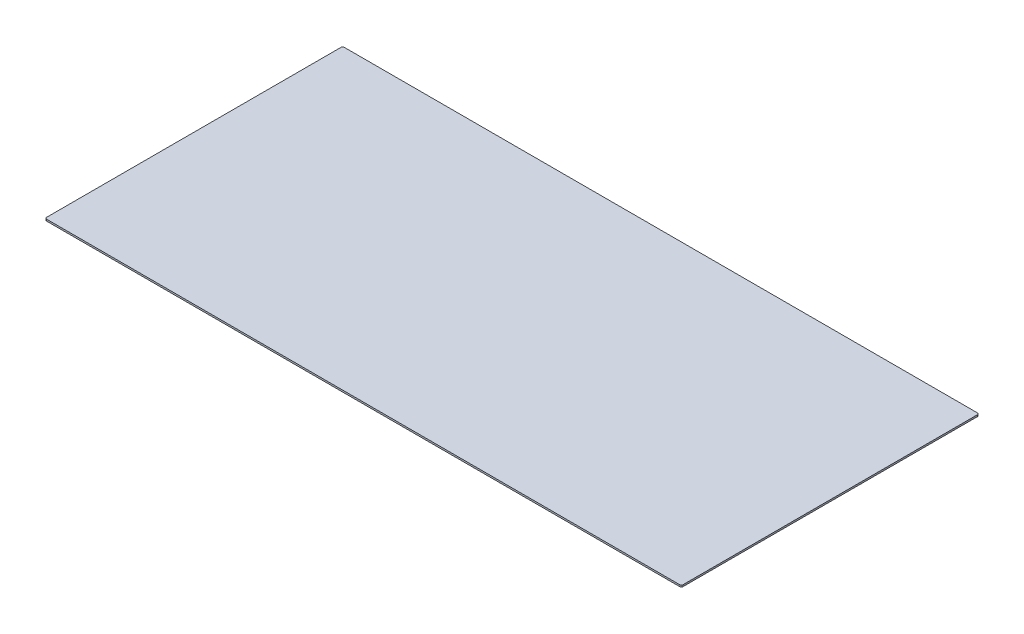
ISO-10303-21;
HEADER;
FILE_DESCRIPTION(('STEP AP214'),'2;1');
FILE_NAME('part.step','',(''),(''),'','','');
FILE_SCHEMA(('AUTOMOTIVE_DESIGN { 1 0 10303 214 1 1 1 1 }'));
ENDSEC;
DATA;
#1=APPLICATION_CONTEXT('core data for automotive mechanical design processes');
#2=APPLICATION_PROTOCOL_DEFINITION('international standard','automotive_design',2000,#1);
#3=PRODUCT_CONTEXT('',#1,'mechanical');
#4=PRODUCT('Part','Part','',(#3));
#5=PRODUCT_RELATED_PRODUCT_CATEGORY('part','',(#4));
#6=PRODUCT_DEFINITION_FORMATION('','',#4);
#7=PRODUCT_DEFINITION_CONTEXT('part definition',#1,'design');
#8=PRODUCT_DEFINITION('design','',#6,#7);
#9=PRODUCT_DEFINITION_SHAPE('','',#8);
#10=(LENGTH_UNIT() NAMED_UNIT(*) SI_UNIT(.MILLI.,.METRE.));
#11=(NAMED_UNIT(*) PLANE_ANGLE_UNIT() SI_UNIT($,.RADIAN.));
#12=(NAMED_UNIT(*) SI_UNIT($,.STERADIAN.) SOLID_ANGLE_UNIT());
#13=UNCERTAINTY_MEASURE_WITH_UNIT(LENGTH_MEASURE(1.E-05),#10,'distance_accuracy_value','');
#14=(GEOMETRIC_REPRESENTATION_CONTEXT(3) GLOBAL_UNCERTAINTY_ASSIGNED_CONTEXT((#13)) GLOBAL_UNIT_ASSIGNED_CONTEXT((#10,
#11,#12)) REPRESENTATION_CONTEXT('',''));
#15=CARTESIAN_POINT('',(0.,0.,0.));
#16=DIRECTION('',(0.,0.,1.));
#17=DIRECTION('',(1.,0.,0.));
#18=AXIS2_PLACEMENT_3D('',#15,#16,#17);
#19=CARTESIAN_POINT('',(587.375,3.175,-273.05));
#20=DIRECTION('',(0.,-1.,0.));
#21=DIRECTION('',(0.,0.,-1.));
#22=AXIS2_PLACEMENT_3D('',#19,#20,#21);
#23=CYLINDRICAL_SURFACE('',#22,3.17500000000001);
#24=CARTESIAN_POINT('',(587.375,0.,-273.05));
#25=DIRECTION('',(0.,1.,0.));
#26=DIRECTION('',(0.,0.,-1.));
#27=AXIS2_PLACEMENT_3D('',#24,#25,#26);
#28=CIRCLE('',#27,3.17500000000001);
#29=CARTESIAN_POINT('',(590.55,0.,-273.05));
#30=VERTEX_POINT('',#29);
#31=CARTESIAN_POINT('',(587.375,0.,-276.225));
#32=VERTEX_POINT('',#31);
#33=EDGE_CURVE('E131',#30,#32,#28,.T.);
#34=ORIENTED_EDGE('',*,*,#33,.T.);
#35=DIRECTION('',(0.,-1.,0.));
#36=VECTOR('',#35,1.);
#37=CARTESIAN_POINT('',(587.375,3.175,-276.225));
#38=LINE('',#37,#36);
#39=CARTESIAN_POINT('',(587.375,3.175,-276.225));
#40=VERTEX_POINT('',#39);
#41=EDGE_CURVE('E11',#40,#32,#38,.T.);
#42=ORIENTED_EDGE('',*,*,#41,.F.);
#43=CARTESIAN_POINT('',(587.375,3.175,-273.05));
#44=DIRECTION('',(0.,1.,0.));
#45=DIRECTION('',(0.,0.,-1.));
#46=AXIS2_PLACEMENT_3D('',#43,#44,#45);
#47=CIRCLE('',#46,3.17500000000001);
#48=CARTESIAN_POINT('',(590.55,3.175,-273.05));
#49=VERTEX_POINT('',#48);
#50=EDGE_CURVE('E145',#49,#40,#47,.T.);
#51=ORIENTED_EDGE('',*,*,#50,.F.);
#52=DIRECTION('',(0.,-1.,0.));
#53=VECTOR('',#52,1.);
#54=CARTESIAN_POINT('',(590.55,3.175,-273.05));
#55=LINE('',#54,#53);
#56=EDGE_CURVE('E127',#49,#30,#55,.T.);
#57=ORIENTED_EDGE('',*,*,#56,.T.);
#58=EDGE_LOOP('',(#34,#42,#51,#57));
#59=FACE_BOUND('',#58,.T.);
#60=ADVANCED_FACE('F35',(#59),#23,.T.);
#61=CARTESIAN_POINT('',(-587.375,3.175,-276.225));
#62=DIRECTION('',(0.,0.,1.));
#63=DIRECTION('',(1.,0.,0.));
#64=AXIS2_PLACEMENT_3D('',#61,#62,#63);
#65=PLANE('',#64);
#66=DIRECTION('',(-1.,0.,0.));
#67=VECTOR('',#66,1.);
#68=CARTESIAN_POINT('',(-587.375,0.,-276.225));
#69=LINE('',#68,#67);
#70=CARTESIAN_POINT('',(-587.375,0.,-276.225));
#71=VERTEX_POINT('',#70);
#72=EDGE_CURVE('E134',#32,#71,#69,.T.);
#73=ORIENTED_EDGE('',*,*,#72,.T.);
#74=DIRECTION('',(0.,-1.,0.));
#75=VECTOR('',#74,1.);
#76=CARTESIAN_POINT('',(-587.375,3.175,-276.225));
#77=LINE('',#76,#75);
#78=CARTESIAN_POINT('',(-587.375,3.175,-276.225));
#79=VERTEX_POINT('',#78);
#80=EDGE_CURVE('E43',#79,#71,#77,.T.);
#81=ORIENTED_EDGE('',*,*,#80,.F.);
#82=DIRECTION('',(-1.,0.,0.));
#83=VECTOR('',#82,1.);
#84=CARTESIAN_POINT('',(-587.375,3.175,-276.225));
#85=LINE('',#84,#83);
#86=EDGE_CURVE('E94',#40,#79,#85,.T.);
#87=ORIENTED_EDGE('',*,*,#86,.F.);
#88=ORIENTED_EDGE('',*,*,#41,.T.);
#89=EDGE_LOOP('',(#73,#81,#87,#88));
#90=FACE_BOUND('',#89,.T.);
#91=ADVANCED_FACE('F180',(#90),#65,.F.);
#92=CARTESIAN_POINT('',(-587.375,3.175,-273.05));
#93=DIRECTION('',(0.,-1.,0.));
#94=DIRECTION('',(0.,0.,-1.));
#95=AXIS2_PLACEMENT_3D('',#92,#93,#94);
#96=CYLINDRICAL_SURFACE('',#95,3.17500000000001);
#97=CARTESIAN_POINT('',(-587.375,0.,-273.05));
#98=DIRECTION('',(0.,1.,0.));
#99=DIRECTION('',(0.,0.,-1.));
#100=AXIS2_PLACEMENT_3D('',#97,#98,#99);
#101=CIRCLE('',#100,3.17500000000001);
#102=CARTESIAN_POINT('',(-590.55,0.,-273.05));
#103=VERTEX_POINT('',#102);
#104=EDGE_CURVE('E136',#71,#103,#101,.T.);
#105=ORIENTED_EDGE('',*,*,#104,.T.);
#106=DIRECTION('',(0.,-1.,0.));
#107=VECTOR('',#106,1.);
#108=CARTESIAN_POINT('',(-590.55,3.175,-273.05));
#109=LINE('',#108,#107);
#110=CARTESIAN_POINT('',(-590.55,3.175,-273.05));
#111=VERTEX_POINT('',#110);
#112=EDGE_CURVE('E152',#111,#103,#109,.T.);
#113=ORIENTED_EDGE('',*,*,#112,.F.);
#114=CARTESIAN_POINT('',(-587.375,3.175,-273.05));
#115=DIRECTION('',(0.,1.,0.));
#116=DIRECTION('',(0.,0.,-1.));
#117=AXIS2_PLACEMENT_3D('',#114,#115,#116);
#118=CIRCLE('',#117,3.17500000000001);
#119=EDGE_CURVE('E160',#79,#111,#118,.T.);
#120=ORIENTED_EDGE('',*,*,#119,.F.);
#121=ORIENTED_EDGE('',*,*,#80,.T.);
#122=EDGE_LOOP('',(#105,#113,#120,#121));
#123=FACE_BOUND('',#122,.T.);
#124=ADVANCED_FACE('F158',(#123),#96,.T.);
#125=CARTESIAN_POINT('',(-590.55,3.175,273.05));
#126=DIRECTION('',(1.,0.,0.));
#127=DIRECTION('',(0.,0.,-1.));
#128=AXIS2_PLACEMENT_3D('',#125,#126,#127);
#129=PLANE('',#128);
#130=DIRECTION('',(0.,0.,1.));
#131=VECTOR('',#130,1.);
#132=CARTESIAN_POINT('',(-590.55,0.,273.05));
#133=LINE('',#132,#131);
#134=CARTESIAN_POINT('',(-590.55,0.,273.05));
#135=VERTEX_POINT('',#134);
#136=EDGE_CURVE('E138',#103,#135,#133,.T.);
#137=ORIENTED_EDGE('',*,*,#136,.T.);
#138=DIRECTION('',(0.,-1.,0.));
#139=VECTOR('',#138,1.);
#140=CARTESIAN_POINT('',(-590.55,3.175,273.05));
#141=LINE('',#140,#139);
#142=CARTESIAN_POINT('',(-590.55,3.175,273.05));
#143=VERTEX_POINT('',#142);
#144=EDGE_CURVE('E149',#143,#135,#141,.T.);
#145=ORIENTED_EDGE('',*,*,#144,.F.);
#146=DIRECTION('',(0.,0.,1.));
#147=VECTOR('',#146,1.);
#148=CARTESIAN_POINT('',(-590.55,3.175,273.05));
#149=LINE('',#148,#147);
#150=EDGE_CURVE('E172',#111,#143,#149,.T.);
#151=ORIENTED_EDGE('',*,*,#150,.F.);
#152=ORIENTED_EDGE('',*,*,#112,.T.);
#153=EDGE_LOOP('',(#137,#145,#151,#152));
#154=FACE_BOUND('',#153,.T.);
#155=ADVANCED_FACE('F168',(#154),#129,.F.);
#156=CARTESIAN_POINT('',(-587.375,3.175,273.05));
#157=DIRECTION('',(0.,-1.,0.));
#158=DIRECTION('',(0.,0.,-1.));
#159=AXIS2_PLACEMENT_3D('',#156,#157,#158);
#160=CYLINDRICAL_SURFACE('',#159,3.17500000000001);
#161=CARTESIAN_POINT('',(-587.375,0.,273.05));
#162=DIRECTION('',(0.,1.,0.));
#163=DIRECTION('',(0.,0.,-1.));
#164=AXIS2_PLACEMENT_3D('',#161,#162,#163);
#165=CIRCLE('',#164,3.17500000000001);
#166=CARTESIAN_POINT('',(-587.375,0.,276.225));
#167=VERTEX_POINT('',#166);
#168=EDGE_CURVE('E140',#135,#167,#165,.T.);
#169=ORIENTED_EDGE('',*,*,#168,.T.);
#170=DIRECTION('',(0.,-1.,0.));
#171=VECTOR('',#170,1.);
#172=CARTESIAN_POINT('',(-587.375,3.175,276.225));
#173=LINE('',#172,#171);
#174=CARTESIAN_POINT('',(-587.375,3.175,276.225));
#175=VERTEX_POINT('',#174);
#176=EDGE_CURVE('E122',#175,#167,#173,.T.);
#177=ORIENTED_EDGE('',*,*,#176,.F.);
#178=CARTESIAN_POINT('',(-587.375,3.175,273.05));
#179=DIRECTION('',(0.,1.,0.));
#180=DIRECTION('',(0.,0.,-1.));
#181=AXIS2_PLACEMENT_3D('',#178,#179,#180);
#182=CIRCLE('',#181,3.17500000000001);
#183=EDGE_CURVE('E113',#143,#175,#182,.T.);
#184=ORIENTED_EDGE('',*,*,#183,.F.);
#185=ORIENTED_EDGE('',*,*,#144,.T.);
#186=EDGE_LOOP('',(#169,#177,#184,#185));
#187=FACE_BOUND('',#186,.T.);
#188=ADVANCED_FACE('F171',(#187),#160,.T.);
#189=CARTESIAN_POINT('',(-587.375,3.175,276.225));
#190=DIRECTION('',(0.,0.,-1.));
#191=DIRECTION('',(-1.,0.,0.));
#192=AXIS2_PLACEMENT_3D('',#189,#190,#191);
#193=PLANE('',#192);
#194=DIRECTION('',(1.,0.,0.));
#195=VECTOR('',#194,1.);
#196=CARTESIAN_POINT('',(-587.375,0.,276.225));
#197=LINE('',#196,#195);
#198=CARTESIAN_POINT('',(587.375,0.,276.225));
#199=VERTEX_POINT('',#198);
#200=EDGE_CURVE('E121',#167,#199,#197,.T.);
#201=ORIENTED_EDGE('',*,*,#200,.T.);
#202=DIRECTION('',(0.,-1.,0.));
#203=VECTOR('',#202,1.);
#204=CARTESIAN_POINT('',(587.375,3.175,276.225));
#205=LINE('',#204,#203);
#206=CARTESIAN_POINT('',(587.375,3.175,276.225));
#207=VERTEX_POINT('',#206);
#208=EDGE_CURVE('E118',#207,#199,#205,.T.);
#209=ORIENTED_EDGE('',*,*,#208,.F.);
#210=DIRECTION('',(1.,0.,0.));
#211=VECTOR('',#210,1.);
#212=CARTESIAN_POINT('',(-587.375,3.175,276.225));
#213=LINE('',#212,#211);
#214=EDGE_CURVE('E107',#175,#207,#213,.T.);
#215=ORIENTED_EDGE('',*,*,#214,.F.);
#216=ORIENTED_EDGE('',*,*,#176,.T.);
#217=EDGE_LOOP('',(#201,#209,#215,#216));
#218=FACE_BOUND('',#217,.T.);
#219=ADVANCED_FACE('F119',(#218),#193,.F.);
#220=CARTESIAN_POINT('',(587.375,3.175,273.05));
#221=DIRECTION('',(0.,-1.,0.));
#222=DIRECTION('',(0.,0.,-1.));
#223=AXIS2_PLACEMENT_3D('',#220,#221,#222);
#224=CYLINDRICAL_SURFACE('',#223,3.17500000000001);
#225=CARTESIAN_POINT('',(587.375,0.,273.05));
#226=DIRECTION('',(0.,1.,0.));
#227=DIRECTION('',(0.,0.,1.));
#228=AXIS2_PLACEMENT_3D('',#225,#226,#227);
#229=CIRCLE('',#228,3.17500000000001);
#230=CARTESIAN_POINT('',(590.55,0.,273.05));
#231=VERTEX_POINT('',#230);
#232=EDGE_CURVE('E80',#199,#231,#229,.T.);
#233=ORIENTED_EDGE('',*,*,#232,.T.);
#234=DIRECTION('',(0.,-1.,0.));
#235=VECTOR('',#234,1.);
#236=CARTESIAN_POINT('',(590.55,3.175,273.05));
#237=LINE('',#236,#235);
#238=CARTESIAN_POINT('',(590.55,3.175,273.05));
#239=VERTEX_POINT('',#238);
#240=EDGE_CURVE('E123',#239,#231,#237,.T.);
#241=ORIENTED_EDGE('',*,*,#240,.F.);
#242=CARTESIAN_POINT('',(587.375,3.175,273.05));
#243=DIRECTION('',(0.,1.,0.));
#244=DIRECTION('',(0.,0.,1.));
#245=AXIS2_PLACEMENT_3D('',#242,#243,#244);
#246=CIRCLE('',#245,3.17500000000001);
#247=EDGE_CURVE('E111',#207,#239,#246,.T.);
#248=ORIENTED_EDGE('',*,*,#247,.F.);
#249=ORIENTED_EDGE('',*,*,#208,.T.);
#250=EDGE_LOOP('',(#233,#241,#248,#249));
#251=FACE_BOUND('',#250,.T.);
#252=ADVANCED_FACE('F125',(#251),#224,.T.);
#253=CARTESIAN_POINT('',(590.55,3.175,273.05));
#254=DIRECTION('',(-1.,0.,0.));
#255=DIRECTION('',(0.,0.,1.));
#256=AXIS2_PLACEMENT_3D('',#253,#254,#255);
#257=PLANE('',#256);
#258=DIRECTION('',(0.,0.,-1.));
#259=VECTOR('',#258,1.);
#260=CARTESIAN_POINT('',(590.55,0.,273.05));
#261=LINE('',#260,#259);
#262=EDGE_CURVE('E86',#231,#30,#261,.T.);
#263=ORIENTED_EDGE('',*,*,#262,.T.);
#264=ORIENTED_EDGE('',*,*,#56,.F.);
#265=DIRECTION('',(0.,0.,-1.));
#266=VECTOR('',#265,1.);
#267=CARTESIAN_POINT('',(590.55,3.175,273.05));
#268=LINE('',#267,#266);
#269=EDGE_CURVE('E51',#239,#49,#268,.T.);
#270=ORIENTED_EDGE('',*,*,#269,.F.);
#271=ORIENTED_EDGE('',*,*,#240,.T.);
#272=EDGE_LOOP('',(#263,#264,#270,#271));
#273=FACE_BOUND('',#272,.T.);
#274=ADVANCED_FACE('F196',(#273),#257,.F.);
#275=CARTESIAN_POINT('',(587.375,3.175,-273.05));
#276=DIRECTION('',(0.,-1.,0.));
#277=DIRECTION('',(0.,0.,-1.));
#278=AXIS2_PLACEMENT_3D('',#275,#276,#277);
#279=PLANE('',#278);
#280=ORIENTED_EDGE('',*,*,#50,.T.);
#281=ORIENTED_EDGE('',*,*,#86,.T.);
#282=ORIENTED_EDGE('',*,*,#119,.T.);
#283=ORIENTED_EDGE('',*,*,#150,.T.);
#284=ORIENTED_EDGE('',*,*,#183,.T.);
#285=ORIENTED_EDGE('',*,*,#214,.T.);
#286=ORIENTED_EDGE('',*,*,#247,.T.);
#287=ORIENTED_EDGE('',*,*,#269,.T.);
#288=EDGE_LOOP('',(#280,#281,#282,#283,#284,#285,#286,#287));
#289=FACE_BOUND('',#288,.T.);
#290=ADVANCED_FACE('F109',(#289),#279,.F.);
#291=CARTESIAN_POINT('',(587.375,0.,-273.05));
#292=DIRECTION('',(0.,-1.,0.));
#293=DIRECTION('',(0.,0.,-1.));
#294=AXIS2_PLACEMENT_3D('',#291,#292,#293);
#295=PLANE('',#294);
#296=ORIENTED_EDGE('',*,*,#33,.F.);
#297=ORIENTED_EDGE('',*,*,#262,.F.);
#298=ORIENTED_EDGE('',*,*,#232,.F.);
#299=ORIENTED_EDGE('',*,*,#200,.F.);
#300=ORIENTED_EDGE('',*,*,#168,.F.);
#301=ORIENTED_EDGE('',*,*,#136,.F.);
#302=ORIENTED_EDGE('',*,*,#104,.F.);
#303=ORIENTED_EDGE('',*,*,#72,.F.);
#304=EDGE_LOOP('',(#296,#297,#298,#299,#300,#301,#302,#303));
#305=FACE_BOUND('',#304,.T.);
#306=ADVANCED_FACE('F164',(#305),#295,.T.);
#307=CLOSED_SHELL('',(#60,#91,#124,#155,#188,#219,#252,#274,#290,#306));
#308=MANIFOLD_SOLID_BREP('B2',#307);
#309=ADVANCED_BREP_SHAPE_REPRESENTATION('',(#18,#308),#14);
#310=SHAPE_DEFINITION_REPRESENTATION(#9,#309);
ENDSEC;
END-ISO-10303-21;
